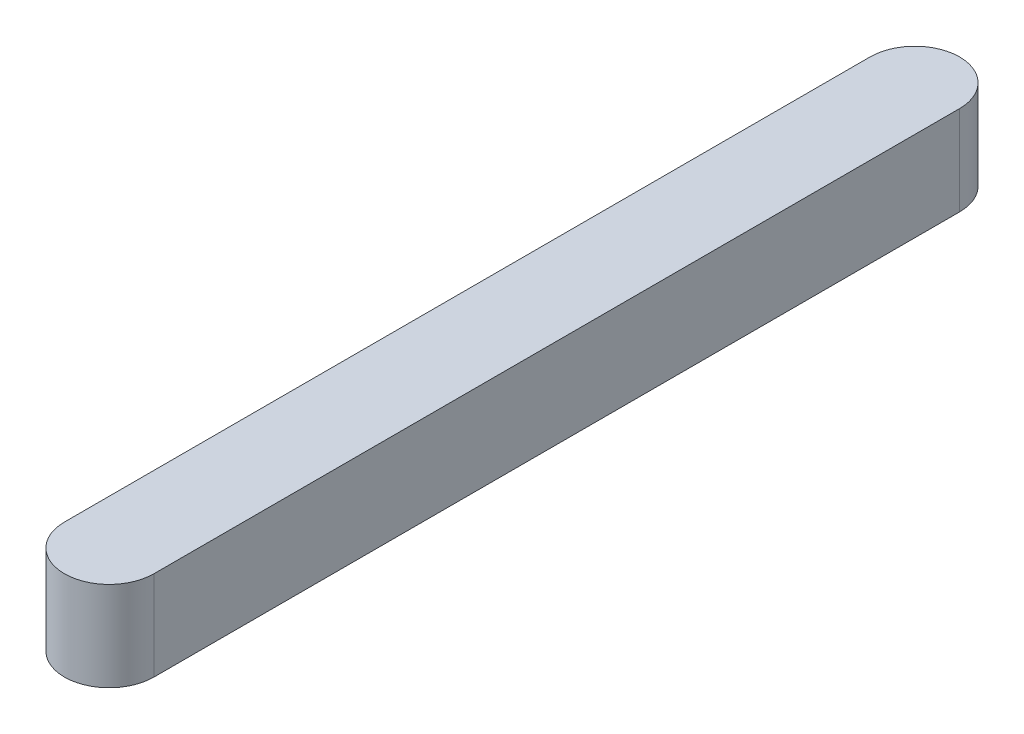
ISO-10303-21;
HEADER;
FILE_DESCRIPTION(('STEP AP214'),'2;1');
FILE_NAME('part.step','',(''),(''),'','','');
FILE_SCHEMA(('AUTOMOTIVE_DESIGN { 1 0 10303 214 1 1 1 1 }'));
ENDSEC;
DATA;
#1=APPLICATION_CONTEXT('core data for automotive mechanical design processes');
#2=APPLICATION_PROTOCOL_DEFINITION('international standard','automotive_design',2000,#1);
#3=PRODUCT_CONTEXT('',#1,'mechanical');
#4=PRODUCT('Part','Part','',(#3));
#5=PRODUCT_RELATED_PRODUCT_CATEGORY('part','',(#4));
#6=PRODUCT_DEFINITION_FORMATION('','',#4);
#7=PRODUCT_DEFINITION_CONTEXT('part definition',#1,'design');
#8=PRODUCT_DEFINITION('design','',#6,#7);
#9=PRODUCT_DEFINITION_SHAPE('','',#8);
#10=(LENGTH_UNIT() NAMED_UNIT(*) SI_UNIT(.MILLI.,.METRE.));
#11=(NAMED_UNIT(*) PLANE_ANGLE_UNIT() SI_UNIT($,.RADIAN.));
#12=(NAMED_UNIT(*) SI_UNIT($,.STERADIAN.) SOLID_ANGLE_UNIT());
#13=UNCERTAINTY_MEASURE_WITH_UNIT(LENGTH_MEASURE(1.E-05),#10,'distance_accuracy_value','');
#14=(GEOMETRIC_REPRESENTATION_CONTEXT(3) GLOBAL_UNCERTAINTY_ASSIGNED_CONTEXT((#13)) GLOBAL_UNIT_ASSIGNED_CONTEXT((#10,
#11,#12)) REPRESENTATION_CONTEXT('',''));
#15=CARTESIAN_POINT('',(0.,0.,0.));
#16=DIRECTION('',(0.,0.,1.));
#17=DIRECTION('',(1.,0.,0.));
#18=AXIS2_PLACEMENT_3D('',#15,#16,#17);
#19=CARTESIAN_POINT('',(0.,1.,-9.));
#20=DIRECTION('',(0.,-1.,0.));
#21=DIRECTION('',(0.,0.,1.));
#22=AXIS2_PLACEMENT_3D('',#19,#20,#21);
#23=CYLINDRICAL_SURFACE('',#22,1.);
#24=CARTESIAN_POINT('',(0.,-1.,-9.));
#25=DIRECTION('',(0.,1.,0.));
#26=DIRECTION('',(0.,0.,1.));
#27=AXIS2_PLACEMENT_3D('',#24,#25,#26);
#28=CIRCLE('',#27,1.);
#29=CARTESIAN_POINT('',(-1.,-1.,-9.));
#30=VERTEX_POINT('',#29);
#31=CARTESIAN_POINT('',(1.,-1.,-9.));
#32=VERTEX_POINT('',#31);
#33=EDGE_CURVE('E40',#30,#32,#28,.F.);
#34=ORIENTED_EDGE('',*,*,#33,.F.);
#35=DIRECTION('',(0.,1.,0.));
#36=VECTOR('',#35,1.);
#37=CARTESIAN_POINT('',(-1.,-1.,-9.));
#38=LINE('',#37,#36);
#39=CARTESIAN_POINT('',(-1.,1.,-9.));
#40=VERTEX_POINT('',#39);
#41=EDGE_CURVE('E97',#40,#30,#38,.F.);
#42=ORIENTED_EDGE('',*,*,#41,.F.);
#43=CARTESIAN_POINT('',(0.,1.,-9.));
#44=DIRECTION('',(0.,1.,0.));
#45=DIRECTION('',(0.,0.,1.));
#46=AXIS2_PLACEMENT_3D('',#43,#44,#45);
#47=CIRCLE('',#46,1.);
#48=CARTESIAN_POINT('',(1.,1.,-9.));
#49=VERTEX_POINT('',#48);
#50=EDGE_CURVE('E84',#49,#40,#47,.T.);
#51=ORIENTED_EDGE('',*,*,#50,.F.);
#52=DIRECTION('',(0.,1.,0.));
#53=VECTOR('',#52,1.);
#54=CARTESIAN_POINT('',(1.,-1.,-9.));
#55=LINE('',#54,#53);
#56=EDGE_CURVE('E90',#32,#49,#55,.T.);
#57=ORIENTED_EDGE('',*,*,#56,.F.);
#58=EDGE_LOOP('',(#34,#42,#51,#57));
#59=FACE_BOUND('',#58,.T.);
#60=ADVANCED_FACE('F37',(#59),#23,.T.);
#61=CARTESIAN_POINT('',(0.,-1.,9.));
#62=DIRECTION('',(0.,1.,0.));
#63=DIRECTION('',(0.,0.,-1.));
#64=AXIS2_PLACEMENT_3D('',#61,#62,#63);
#65=CYLINDRICAL_SURFACE('',#64,0.999999999999999);
#66=CARTESIAN_POINT('',(0.,-1.,9.));
#67=DIRECTION('',(0.,-1.,0.));
#68=DIRECTION('',(0.,0.,-1.));
#69=AXIS2_PLACEMENT_3D('',#66,#67,#68);
#70=CIRCLE('',#69,0.999999999999999);
#71=CARTESIAN_POINT('',(1.,-1.,9.));
#72=VERTEX_POINT('',#71);
#73=CARTESIAN_POINT('',(-1.,-1.,9.));
#74=VERTEX_POINT('',#73);
#75=EDGE_CURVE('E98',#72,#74,#70,.T.);
#76=ORIENTED_EDGE('',*,*,#75,.F.);
#77=DIRECTION('',(0.,1.,0.));
#78=VECTOR('',#77,1.);
#79=CARTESIAN_POINT('',(1.,-1.,9.));
#80=LINE('',#79,#78);
#81=CARTESIAN_POINT('',(1.,1.,9.));
#82=VERTEX_POINT('',#81);
#83=EDGE_CURVE('E89',#82,#72,#80,.F.);
#84=ORIENTED_EDGE('',*,*,#83,.F.);
#85=CARTESIAN_POINT('',(0.,1.,9.));
#86=DIRECTION('',(0.,1.,0.));
#87=DIRECTION('',(0.,0.,1.));
#88=AXIS2_PLACEMENT_3D('',#85,#86,#87);
#89=CIRCLE('',#88,0.999999999999999);
#90=CARTESIAN_POINT('',(-1.,1.,9.));
#91=VERTEX_POINT('',#90);
#92=EDGE_CURVE('E87',#91,#82,#89,.T.);
#93=ORIENTED_EDGE('',*,*,#92,.F.);
#94=DIRECTION('',(0.,1.,0.));
#95=VECTOR('',#94,1.);
#96=CARTESIAN_POINT('',(-1.,-1.,9.));
#97=LINE('',#96,#95);
#98=EDGE_CURVE('E103',#74,#91,#97,.T.);
#99=ORIENTED_EDGE('',*,*,#98,.F.);
#100=EDGE_LOOP('',(#76,#84,#93,#99));
#101=FACE_BOUND('',#100,.T.);
#102=ADVANCED_FACE('F110',(#101),#65,.T.);
#103=CARTESIAN_POINT('',(-1.,1.,-10.));
#104=DIRECTION('',(0.,-1.,0.));
#105=DIRECTION('',(0.,0.,1.));
#106=AXIS2_PLACEMENT_3D('',#103,#104,#105);
#107=PLANE('',#106);
#108=ORIENTED_EDGE('',*,*,#92,.T.);
#109=DIRECTION('',(0.,0.,-1.));
#110=VECTOR('',#109,1.);
#111=CARTESIAN_POINT('',(1.,1.,-10.));
#112=LINE('',#111,#110);
#113=EDGE_CURVE('E81',#49,#82,#112,.F.);
#114=ORIENTED_EDGE('',*,*,#113,.F.);
#115=ORIENTED_EDGE('',*,*,#50,.T.);
#116=DIRECTION('',(0.,0.,1.));
#117=VECTOR('',#116,1.);
#118=CARTESIAN_POINT('',(-1.,1.,-10.));
#119=LINE('',#118,#117);
#120=EDGE_CURVE('E73',#91,#40,#119,.F.);
#121=ORIENTED_EDGE('',*,*,#120,.F.);
#122=EDGE_LOOP('',(#108,#114,#115,#121));
#123=FACE_BOUND('',#122,.T.);
#124=ADVANCED_FACE('F82',(#123),#107,.F.);
#125=CARTESIAN_POINT('',(1.,-1.,-10.));
#126=DIRECTION('',(-1.,0.,0.));
#127=DIRECTION('',(0.,0.,-1.));
#128=AXIS2_PLACEMENT_3D('',#125,#126,#127);
#129=PLANE('',#128);
#130=ORIENTED_EDGE('',*,*,#83,.T.);
#131=DIRECTION('',(0.,0.,-1.));
#132=VECTOR('',#131,1.);
#133=CARTESIAN_POINT('',(1.,-1.,-10.));
#134=LINE('',#133,#132);
#135=EDGE_CURVE('E46',#32,#72,#134,.F.);
#136=ORIENTED_EDGE('',*,*,#135,.F.);
#137=ORIENTED_EDGE('',*,*,#56,.T.);
#138=ORIENTED_EDGE('',*,*,#113,.T.);
#139=EDGE_LOOP('',(#130,#136,#137,#138));
#140=FACE_BOUND('',#139,.T.);
#141=ADVANCED_FACE('F93',(#140),#129,.F.);
#142=CARTESIAN_POINT('',(-1.,-1.,-10.));
#143=DIRECTION('',(1.,0.,0.));
#144=DIRECTION('',(0.,0.,1.));
#145=AXIS2_PLACEMENT_3D('',#142,#143,#144);
#146=PLANE('',#145);
#147=ORIENTED_EDGE('',*,*,#98,.T.);
#148=ORIENTED_EDGE('',*,*,#120,.T.);
#149=ORIENTED_EDGE('',*,*,#41,.T.);
#150=DIRECTION('',(0.,0.,-1.));
#151=VECTOR('',#150,1.);
#152=CARTESIAN_POINT('',(-1.,-1.,-10.));
#153=LINE('',#152,#151);
#154=EDGE_CURVE('E11',#74,#30,#153,.T.);
#155=ORIENTED_EDGE('',*,*,#154,.F.);
#156=EDGE_LOOP('',(#147,#148,#149,#155));
#157=FACE_BOUND('',#156,.T.);
#158=ADVANCED_FACE('F111',(#157),#146,.F.);
#159=CARTESIAN_POINT('',(-1.,-1.,-10.));
#160=DIRECTION('',(0.,1.,0.));
#161=DIRECTION('',(0.,0.,-1.));
#162=AXIS2_PLACEMENT_3D('',#159,#160,#161);
#163=PLANE('',#162);
#164=ORIENTED_EDGE('',*,*,#75,.T.);
#165=ORIENTED_EDGE('',*,*,#154,.T.);
#166=ORIENTED_EDGE('',*,*,#33,.T.);
#167=ORIENTED_EDGE('',*,*,#135,.T.);
#168=EDGE_LOOP('',(#164,#165,#166,#167));
#169=FACE_BOUND('',#168,.T.);
#170=ADVANCED_FACE('F107',(#169),#163,.F.);
#171=CLOSED_SHELL('',(#60,#102,#124,#141,#158,#170));
#172=MANIFOLD_SOLID_BREP('B2',#171);
#173=ADVANCED_BREP_SHAPE_REPRESENTATION('',(#18,#172),#14);
#174=SHAPE_DEFINITION_REPRESENTATION(#9,#173);
ENDSEC;
END-ISO-10303-21;
